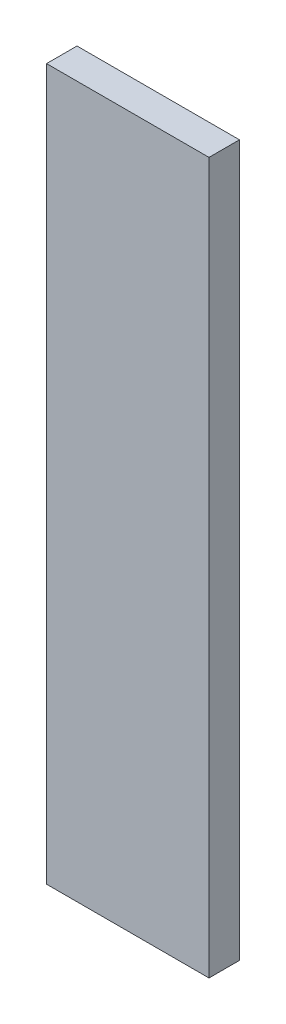
ISO-10303-21;
HEADER;
FILE_DESCRIPTION(('STEP AP214'),'2;1');
FILE_NAME('part.step','',(''),(''),'','','');
FILE_SCHEMA(('AUTOMOTIVE_DESIGN { 1 0 10303 214 1 1 1 1 }'));
ENDSEC;
DATA;
#1=APPLICATION_CONTEXT('core data for automotive mechanical design processes');
#2=APPLICATION_PROTOCOL_DEFINITION('international standard','automotive_design',2000,#1);
#3=PRODUCT_CONTEXT('',#1,'mechanical');
#4=PRODUCT('Part','Part','',(#3));
#5=PRODUCT_RELATED_PRODUCT_CATEGORY('part','',(#4));
#6=PRODUCT_DEFINITION_FORMATION('','',#4);
#7=PRODUCT_DEFINITION_CONTEXT('part definition',#1,'design');
#8=PRODUCT_DEFINITION('design','',#6,#7);
#9=PRODUCT_DEFINITION_SHAPE('','',#8);
#10=(LENGTH_UNIT() NAMED_UNIT(*) SI_UNIT(.MILLI.,.METRE.));
#11=(NAMED_UNIT(*) PLANE_ANGLE_UNIT() SI_UNIT($,.RADIAN.));
#12=(NAMED_UNIT(*) SI_UNIT($,.STERADIAN.) SOLID_ANGLE_UNIT());
#13=UNCERTAINTY_MEASURE_WITH_UNIT(LENGTH_MEASURE(1.E-05),#10,'distance_accuracy_value','');
#14=(GEOMETRIC_REPRESENTATION_CONTEXT(3) GLOBAL_UNCERTAINTY_ASSIGNED_CONTEXT((#13)) GLOBAL_UNIT_ASSIGNED_CONTEXT((#10,
#11,#12)) REPRESENTATION_CONTEXT('',''));
#15=CARTESIAN_POINT('',(0.,0.,0.));
#16=DIRECTION('',(0.,0.,1.));
#17=DIRECTION('',(1.,0.,0.));
#18=AXIS2_PLACEMENT_3D('',#15,#16,#17);
#19=CARTESIAN_POINT('',(200.,-80.,-5.99999999999999));
#20=DIRECTION('',(1.,0.,0.));
#21=DIRECTION('',(0.,0.,-1.));
#22=AXIS2_PLACEMENT_3D('',#19,#20,#21);
#23=PLANE('',#22);
#24=DIRECTION('',(0.,1.,0.));
#25=VECTOR('',#24,1.);
#26=CARTESIAN_POINT('',(200.,-80.,-2.99999999999999));
#27=LINE('',#26,#25);
#28=CARTESIAN_POINT('',(200.,-80.,-2.99999999999999));
#29=VERTEX_POINT('',#28);
#30=CARTESIAN_POINT('',(200.,-9.99999999999278,-3.));
#31=VERTEX_POINT('',#30);
#32=EDGE_CURVE('E97',#29,#31,#27,.T.);
#33=ORIENTED_EDGE('',*,*,#32,.T.);
#34=DIRECTION('',(0.,0.,1.));
#35=VECTOR('',#34,1.);
#36=CARTESIAN_POINT('',(200.,-9.99999999999278,-6.));
#37=LINE('',#36,#35);
#38=CARTESIAN_POINT('',(200.,-9.99999999999278,-6.));
#39=VERTEX_POINT('',#38);
#40=EDGE_CURVE('E11',#39,#31,#37,.T.);
#41=ORIENTED_EDGE('',*,*,#40,.F.);
#42=DIRECTION('',(0.,1.,0.));
#43=VECTOR('',#42,1.);
#44=CARTESIAN_POINT('',(200.,-80.,-5.99999999999999));
#45=LINE('',#44,#43);
#46=CARTESIAN_POINT('',(200.,-80.,-5.99999999999999));
#47=VERTEX_POINT('',#46);
#48=EDGE_CURVE('E85',#47,#39,#45,.T.);
#49=ORIENTED_EDGE('',*,*,#48,.F.);
#50=DIRECTION('',(0.,0.,1.));
#51=VECTOR('',#50,1.);
#52=CARTESIAN_POINT('',(200.,-80.,-5.99999999999999));
#53=LINE('',#52,#51);
#54=EDGE_CURVE('E93',#47,#29,#53,.T.);
#55=ORIENTED_EDGE('',*,*,#54,.T.);
#56=EDGE_LOOP('',(#33,#41,#49,#55));
#57=FACE_BOUND('',#56,.T.);
#58=ADVANCED_FACE('F34',(#57),#23,.F.);
#59=CARTESIAN_POINT('',(200.,-9.99999999999278,-6.));
#60=DIRECTION('',(0.,-1.,0.));
#61=DIRECTION('',(0.,0.,-1.));
#62=AXIS2_PLACEMENT_3D('',#59,#60,#61);
#63=PLANE('',#62);
#64=DIRECTION('',(1.,0.,0.));
#65=VECTOR('',#64,1.);
#66=CARTESIAN_POINT('',(200.,-9.99999999999278,-3.));
#67=LINE('',#66,#65);
#68=CARTESIAN_POINT('',(216.,-9.99999999999278,-3.));
#69=VERTEX_POINT('',#68);
#70=EDGE_CURVE('E89',#31,#69,#67,.T.);
#71=ORIENTED_EDGE('',*,*,#70,.T.);
#72=DIRECTION('',(0.,0.,1.));
#73=VECTOR('',#72,1.);
#74=CARTESIAN_POINT('',(216.,-9.99999999999278,-6.));
#75=LINE('',#74,#73);
#76=CARTESIAN_POINT('',(216.,-9.99999999999278,-6.));
#77=VERTEX_POINT('',#76);
#78=EDGE_CURVE('E42',#77,#69,#75,.T.);
#79=ORIENTED_EDGE('',*,*,#78,.F.);
#80=DIRECTION('',(1.,0.,0.));
#81=VECTOR('',#80,1.);
#82=CARTESIAN_POINT('',(200.,-9.99999999999278,-6.));
#83=LINE('',#82,#81);
#84=EDGE_CURVE('E80',#39,#77,#83,.T.);
#85=ORIENTED_EDGE('',*,*,#84,.F.);
#86=ORIENTED_EDGE('',*,*,#40,.T.);
#87=EDGE_LOOP('',(#71,#79,#85,#86));
#88=FACE_BOUND('',#87,.T.);
#89=ADVANCED_FACE('F88',(#88),#63,.F.);
#90=CARTESIAN_POINT('',(216.,-9.99999999999278,-6.));
#91=DIRECTION('',(-1.,0.,0.));
#92=DIRECTION('',(0.,0.,1.));
#93=AXIS2_PLACEMENT_3D('',#90,#91,#92);
#94=PLANE('',#93);
#95=DIRECTION('',(0.,-1.,0.));
#96=VECTOR('',#95,1.);
#97=CARTESIAN_POINT('',(216.,-9.99999999999278,-3.));
#98=LINE('',#97,#96);
#99=CARTESIAN_POINT('',(216.,-80.,-2.99999999999999));
#100=VERTEX_POINT('',#99);
#101=EDGE_CURVE('E67',#69,#100,#98,.T.);
#102=ORIENTED_EDGE('',*,*,#101,.T.);
#103=DIRECTION('',(0.,0.,1.));
#104=VECTOR('',#103,1.);
#105=CARTESIAN_POINT('',(216.,-80.,-5.99999999999999));
#106=LINE('',#105,#104);
#107=CARTESIAN_POINT('',(216.,-80.,-5.99999999999999));
#108=VERTEX_POINT('',#107);
#109=EDGE_CURVE('E90',#108,#100,#106,.T.);
#110=ORIENTED_EDGE('',*,*,#109,.F.);
#111=DIRECTION('',(0.,-1.,0.));
#112=VECTOR('',#111,1.);
#113=CARTESIAN_POINT('',(216.,-9.99999999999278,-6.));
#114=LINE('',#113,#112);
#115=EDGE_CURVE('E83',#77,#108,#114,.T.);
#116=ORIENTED_EDGE('',*,*,#115,.F.);
#117=ORIENTED_EDGE('',*,*,#78,.T.);
#118=EDGE_LOOP('',(#102,#110,#116,#117));
#119=FACE_BOUND('',#118,.T.);
#120=ADVANCED_FACE('F91',(#119),#94,.F.);
#121=CARTESIAN_POINT('',(216.,-80.,-5.99999999999999));
#122=DIRECTION('',(0.,1.,0.));
#123=DIRECTION('',(0.,0.,1.));
#124=AXIS2_PLACEMENT_3D('',#121,#122,#123);
#125=PLANE('',#124);
#126=DIRECTION('',(-1.,0.,0.));
#127=VECTOR('',#126,1.);
#128=CARTESIAN_POINT('',(216.,-80.,-2.99999999999999));
#129=LINE('',#128,#127);
#130=EDGE_CURVE('E73',#100,#29,#129,.T.);
#131=ORIENTED_EDGE('',*,*,#130,.T.);
#132=ORIENTED_EDGE('',*,*,#54,.F.);
#133=DIRECTION('',(-1.,0.,0.));
#134=VECTOR('',#133,1.);
#135=CARTESIAN_POINT('',(216.,-80.,-5.99999999999999));
#136=LINE('',#135,#134);
#137=EDGE_CURVE('E50',#108,#47,#136,.T.);
#138=ORIENTED_EDGE('',*,*,#137,.F.);
#139=ORIENTED_EDGE('',*,*,#109,.T.);
#140=EDGE_LOOP('',(#131,#132,#138,#139));
#141=FACE_BOUND('',#140,.T.);
#142=ADVANCED_FACE('F104',(#141),#125,.F.);
#143=CARTESIAN_POINT('',(0.,0.,-6.));
#144=DIRECTION('',(0.,0.,-1.));
#145=DIRECTION('',(0.,1.,0.));
#146=AXIS2_PLACEMENT_3D('',#143,#144,#145);
#147=PLANE('',#146);
#148=ORIENTED_EDGE('',*,*,#48,.T.);
#149=ORIENTED_EDGE('',*,*,#84,.T.);
#150=ORIENTED_EDGE('',*,*,#115,.T.);
#151=ORIENTED_EDGE('',*,*,#137,.T.);
#152=EDGE_LOOP('',(#148,#149,#150,#151));
#153=FACE_BOUND('',#152,.T.);
#154=ADVANCED_FACE('F81',(#153),#147,.T.);
#155=CARTESIAN_POINT('',(0.,0.,-3.));
#156=DIRECTION('',(0.,0.,-1.));
#157=DIRECTION('',(0.,1.,0.));
#158=AXIS2_PLACEMENT_3D('',#155,#156,#157);
#159=PLANE('',#158);
#160=ORIENTED_EDGE('',*,*,#32,.F.);
#161=ORIENTED_EDGE('',*,*,#130,.F.);
#162=ORIENTED_EDGE('',*,*,#101,.F.);
#163=ORIENTED_EDGE('',*,*,#70,.F.);
#164=EDGE_LOOP('',(#160,#161,#162,#163));
#165=FACE_BOUND('',#164,.T.);
#166=ADVANCED_FACE('F107',(#165),#159,.F.);
#167=CLOSED_SHELL('',(#58,#89,#120,#142,#154,#166));
#168=MANIFOLD_SOLID_BREP('B2',#167);
#169=ADVANCED_BREP_SHAPE_REPRESENTATION('',(#18,#168),#14);
#170=SHAPE_DEFINITION_REPRESENTATION(#9,#169);
ENDSEC;
END-ISO-10303-21;
